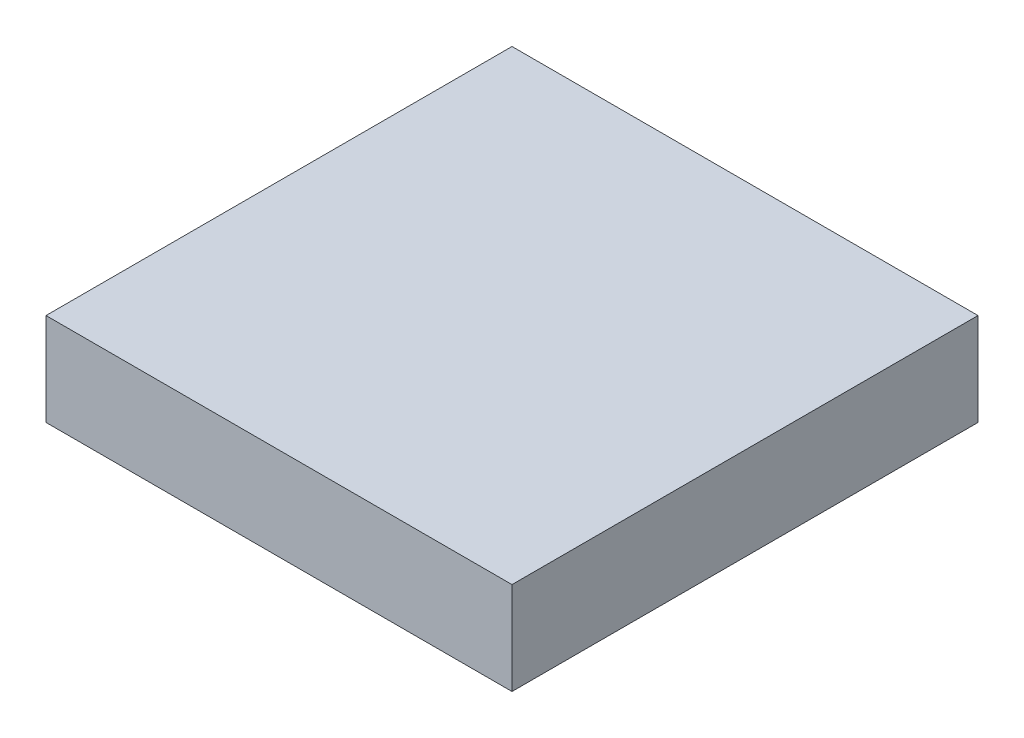
ISO-10303-21;
HEADER;
FILE_DESCRIPTION(('STEP AP214'),'2;1');
FILE_NAME('part.step','',(''),(''),'','','');
FILE_SCHEMA(('AUTOMOTIVE_DESIGN { 1 0 10303 214 1 1 1 1 }'));
ENDSEC;
DATA;
#1=APPLICATION_CONTEXT('core data for automotive mechanical design processes');
#2=APPLICATION_PROTOCOL_DEFINITION('international standard','automotive_design',2000,#1);
#3=PRODUCT_CONTEXT('',#1,'mechanical');
#4=PRODUCT('Part','Part','',(#3));
#5=PRODUCT_RELATED_PRODUCT_CATEGORY('part','',(#4));
#6=PRODUCT_DEFINITION_FORMATION('','',#4);
#7=PRODUCT_DEFINITION_CONTEXT('part definition',#1,'design');
#8=PRODUCT_DEFINITION('design','',#6,#7);
#9=PRODUCT_DEFINITION_SHAPE('','',#8);
#10=(LENGTH_UNIT() NAMED_UNIT(*) SI_UNIT(.MILLI.,.METRE.));
#11=(NAMED_UNIT(*) PLANE_ANGLE_UNIT() SI_UNIT($,.RADIAN.));
#12=(NAMED_UNIT(*) SI_UNIT($,.STERADIAN.) SOLID_ANGLE_UNIT());
#13=UNCERTAINTY_MEASURE_WITH_UNIT(LENGTH_MEASURE(1.E-05),#10,'distance_accuracy_value','');
#14=(GEOMETRIC_REPRESENTATION_CONTEXT(3) GLOBAL_UNCERTAINTY_ASSIGNED_CONTEXT((#13)) GLOBAL_UNIT_ASSIGNED_CONTEXT((#10,
#11,#12)) REPRESENTATION_CONTEXT('',''));
#15=CARTESIAN_POINT('',(0.,0.,0.));
#16=DIRECTION('',(0.,0.,1.));
#17=DIRECTION('',(1.,0.,0.));
#18=AXIS2_PLACEMENT_3D('',#15,#16,#17);
#19=CARTESIAN_POINT('',(0.,1.59,0.));
#20=DIRECTION('',(1.,0.,0.));
#21=DIRECTION('',(0.,0.,-1.));
#22=AXIS2_PLACEMENT_3D('',#19,#20,#21);
#23=PLANE('',#22);
#24=DIRECTION('',(0.,0.,1.));
#25=VECTOR('',#24,1.);
#26=CARTESIAN_POINT('',(0.,0.,0.));
#27=LINE('',#26,#25);
#28=CARTESIAN_POINT('',(0.,0.,-8.));
#29=VERTEX_POINT('',#28);
#30=CARTESIAN_POINT('',(0.,0.,0.));
#31=VERTEX_POINT('',#30);
#32=EDGE_CURVE('E100',#29,#31,#27,.T.);
#33=ORIENTED_EDGE('',*,*,#32,.T.);
#34=DIRECTION('',(0.,-1.,0.));
#35=VECTOR('',#34,1.);
#36=CARTESIAN_POINT('',(0.,1.59,0.));
#37=LINE('',#36,#35);
#38=CARTESIAN_POINT('',(0.,1.59,0.));
#39=VERTEX_POINT('',#38);
#40=EDGE_CURVE('E11',#39,#31,#37,.T.);
#41=ORIENTED_EDGE('',*,*,#40,.F.);
#42=DIRECTION('',(0.,0.,1.));
#43=VECTOR('',#42,1.);
#44=CARTESIAN_POINT('',(0.,1.59,0.));
#45=LINE('',#44,#43);
#46=CARTESIAN_POINT('',(0.,1.59,-8.));
#47=VERTEX_POINT('',#46);
#48=EDGE_CURVE('E88',#47,#39,#45,.T.);
#49=ORIENTED_EDGE('',*,*,#48,.F.);
#50=DIRECTION('',(0.,-1.,0.));
#51=VECTOR('',#50,1.);
#52=CARTESIAN_POINT('',(0.,1.59,-8.));
#53=LINE('',#52,#51);
#54=EDGE_CURVE('E96',#47,#29,#53,.T.);
#55=ORIENTED_EDGE('',*,*,#54,.T.);
#56=EDGE_LOOP('',(#33,#41,#49,#55));
#57=FACE_BOUND('',#56,.T.);
#58=ADVANCED_FACE('F37',(#57),#23,.F.);
#59=CARTESIAN_POINT('',(0.,1.59,0.));
#60=DIRECTION('',(0.,0.,-1.));
#61=DIRECTION('',(-1.,0.,0.));
#62=AXIS2_PLACEMENT_3D('',#59,#60,#61);
#63=PLANE('',#62);
#64=DIRECTION('',(1.,0.,0.));
#65=VECTOR('',#64,1.);
#66=CARTESIAN_POINT('',(0.,0.,0.));
#67=LINE('',#66,#65);
#68=CARTESIAN_POINT('',(8.,0.,0.));
#69=VERTEX_POINT('',#68);
#70=EDGE_CURVE('E92',#31,#69,#67,.T.);
#71=ORIENTED_EDGE('',*,*,#70,.T.);
#72=DIRECTION('',(0.,-1.,0.));
#73=VECTOR('',#72,1.);
#74=CARTESIAN_POINT('',(8.,1.59,0.));
#75=LINE('',#74,#73);
#76=CARTESIAN_POINT('',(8.,1.59,0.));
#77=VERTEX_POINT('',#76);
#78=EDGE_CURVE('E45',#77,#69,#75,.T.);
#79=ORIENTED_EDGE('',*,*,#78,.F.);
#80=DIRECTION('',(1.,0.,0.));
#81=VECTOR('',#80,1.);
#82=CARTESIAN_POINT('',(0.,1.59,0.));
#83=LINE('',#82,#81);
#84=EDGE_CURVE('E83',#39,#77,#83,.T.);
#85=ORIENTED_EDGE('',*,*,#84,.F.);
#86=ORIENTED_EDGE('',*,*,#40,.T.);
#87=EDGE_LOOP('',(#71,#79,#85,#86));
#88=FACE_BOUND('',#87,.T.);
#89=ADVANCED_FACE('F91',(#88),#63,.F.);
#90=CARTESIAN_POINT('',(8.,1.59,0.));
#91=DIRECTION('',(-1.,0.,0.));
#92=DIRECTION('',(0.,0.,1.));
#93=AXIS2_PLACEMENT_3D('',#90,#91,#92);
#94=PLANE('',#93);
#95=DIRECTION('',(0.,0.,-1.));
#96=VECTOR('',#95,1.);
#97=CARTESIAN_POINT('',(8.,0.,0.));
#98=LINE('',#97,#96);
#99=CARTESIAN_POINT('',(8.,0.,-8.));
#100=VERTEX_POINT('',#99);
#101=EDGE_CURVE('E70',#69,#100,#98,.T.);
#102=ORIENTED_EDGE('',*,*,#101,.T.);
#103=DIRECTION('',(0.,-1.,0.));
#104=VECTOR('',#103,1.);
#105=CARTESIAN_POINT('',(8.,1.59,-8.));
#106=LINE('',#105,#104);
#107=CARTESIAN_POINT('',(8.,1.59,-8.));
#108=VERTEX_POINT('',#107);
#109=EDGE_CURVE('E93',#108,#100,#106,.T.);
#110=ORIENTED_EDGE('',*,*,#109,.F.);
#111=DIRECTION('',(0.,0.,-1.));
#112=VECTOR('',#111,1.);
#113=CARTESIAN_POINT('',(8.,1.59,0.));
#114=LINE('',#113,#112);
#115=EDGE_CURVE('E86',#77,#108,#114,.T.);
#116=ORIENTED_EDGE('',*,*,#115,.F.);
#117=ORIENTED_EDGE('',*,*,#78,.T.);
#118=EDGE_LOOP('',(#102,#110,#116,#117));
#119=FACE_BOUND('',#118,.T.);
#120=ADVANCED_FACE('F94',(#119),#94,.F.);
#121=CARTESIAN_POINT('',(0.,1.59,-8.));
#122=DIRECTION('',(0.,0.,1.));
#123=DIRECTION('',(1.,0.,0.));
#124=AXIS2_PLACEMENT_3D('',#121,#122,#123);
#125=PLANE('',#124);
#126=DIRECTION('',(-1.,0.,0.));
#127=VECTOR('',#126,1.);
#128=CARTESIAN_POINT('',(0.,0.,-8.));
#129=LINE('',#128,#127);
#130=EDGE_CURVE('E76',#100,#29,#129,.T.);
#131=ORIENTED_EDGE('',*,*,#130,.T.);
#132=ORIENTED_EDGE('',*,*,#54,.F.);
#133=DIRECTION('',(-1.,0.,0.));
#134=VECTOR('',#133,1.);
#135=CARTESIAN_POINT('',(0.,1.59,-8.));
#136=LINE('',#135,#134);
#137=EDGE_CURVE('E53',#108,#47,#136,.T.);
#138=ORIENTED_EDGE('',*,*,#137,.F.);
#139=ORIENTED_EDGE('',*,*,#109,.T.);
#140=EDGE_LOOP('',(#131,#132,#138,#139));
#141=FACE_BOUND('',#140,.T.);
#142=ADVANCED_FACE('F107',(#141),#125,.F.);
#143=CARTESIAN_POINT('',(0.,1.59,0.));
#144=DIRECTION('',(0.,-1.,0.));
#145=DIRECTION('',(0.,0.,-1.));
#146=AXIS2_PLACEMENT_3D('',#143,#144,#145);
#147=PLANE('',#146);
#148=ORIENTED_EDGE('',*,*,#48,.T.);
#149=ORIENTED_EDGE('',*,*,#84,.T.);
#150=ORIENTED_EDGE('',*,*,#115,.T.);
#151=ORIENTED_EDGE('',*,*,#137,.T.);
#152=EDGE_LOOP('',(#148,#149,#150,#151));
#153=FACE_BOUND('',#152,.T.);
#154=ADVANCED_FACE('F84',(#153),#147,.F.);
#155=CARTESIAN_POINT('',(0.,0.,0.));
#156=DIRECTION('',(0.,-1.,0.));
#157=DIRECTION('',(0.,0.,-1.));
#158=AXIS2_PLACEMENT_3D('',#155,#156,#157);
#159=PLANE('',#158);
#160=ORIENTED_EDGE('',*,*,#32,.F.);
#161=ORIENTED_EDGE('',*,*,#130,.F.);
#162=ORIENTED_EDGE('',*,*,#101,.F.);
#163=ORIENTED_EDGE('',*,*,#70,.F.);
#164=EDGE_LOOP('',(#160,#161,#162,#163));
#165=FACE_BOUND('',#164,.T.);
#166=ADVANCED_FACE('F110',(#165),#159,.T.);
#167=CLOSED_SHELL('',(#58,#89,#120,#142,#154,#166));
#168=MANIFOLD_SOLID_BREP('B2',#167);
#169=ADVANCED_BREP_SHAPE_REPRESENTATION('',(#18,#168),#14);
#170=SHAPE_DEFINITION_REPRESENTATION(#9,#169);
ENDSEC;
END-ISO-10303-21;
